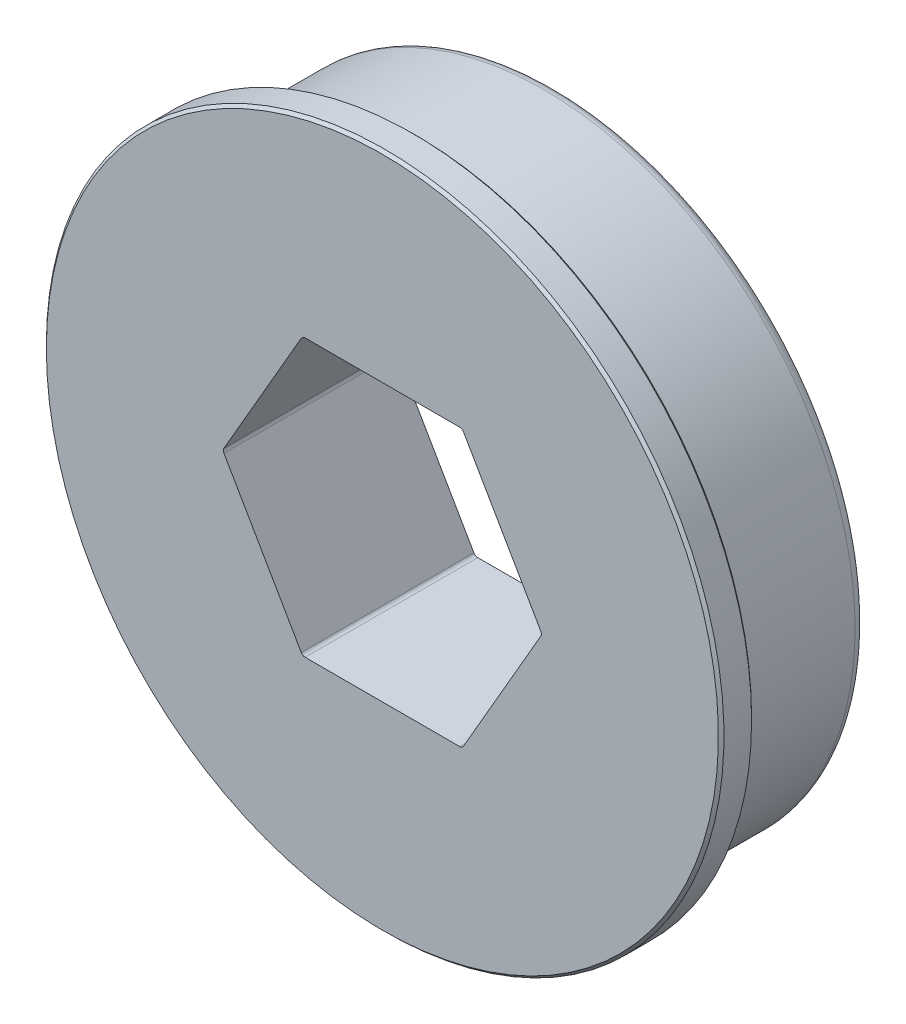
ISO-10303-21;
HEADER;
FILE_DESCRIPTION(('STEP AP214'),'2;1');
FILE_NAME('part.step','',(''),(''),'','','');
FILE_SCHEMA(('AUTOMOTIVE_DESIGN { 1 0 10303 214 1 1 1 1 }'));
ENDSEC;
DATA;
#1=APPLICATION_CONTEXT('core data for automotive mechanical design processes');
#2=APPLICATION_PROTOCOL_DEFINITION('international standard','automotive_design',2000,#1);
#3=PRODUCT_CONTEXT('',#1,'mechanical');
#4=PRODUCT('Part','Part','',(#3));
#5=PRODUCT_RELATED_PRODUCT_CATEGORY('part','',(#4));
#6=PRODUCT_DEFINITION_FORMATION('','',#4);
#7=PRODUCT_DEFINITION_CONTEXT('part definition',#1,'design');
#8=PRODUCT_DEFINITION('design','',#6,#7);
#9=PRODUCT_DEFINITION_SHAPE('','',#8);
#10=(LENGTH_UNIT() NAMED_UNIT(*) SI_UNIT(.MILLI.,.METRE.));
#11=(NAMED_UNIT(*) PLANE_ANGLE_UNIT() SI_UNIT($,.RADIAN.));
#12=(NAMED_UNIT(*) SI_UNIT($,.STERADIAN.) SOLID_ANGLE_UNIT());
#13=UNCERTAINTY_MEASURE_WITH_UNIT(LENGTH_MEASURE(1.E-05),#10,'distance_accuracy_value','');
#14=(GEOMETRIC_REPRESENTATION_CONTEXT(3) GLOBAL_UNCERTAINTY_ASSIGNED_CONTEXT((#13)) GLOBAL_UNIT_ASSIGNED_CONTEXT((#10,
#11,#12)) REPRESENTATION_CONTEXT('',''));
#15=CARTESIAN_POINT('',(0.,0.,0.));
#16=DIRECTION('',(0.,0.,1.));
#17=DIRECTION('',(1.,0.,0.));
#18=AXIS2_PLACEMENT_3D('',#15,#16,#17);
#19=CARTESIAN_POINT('',(0.,0.,7.92734));
#20=DIRECTION('',(0.,0.,-1.));
#21=DIRECTION('',(-1.,0.,0.));
#22=AXIS2_PLACEMENT_3D('',#19,#20,#21);
#23=CYLINDRICAL_SURFACE('',#22,13.97);
#24=CARTESIAN_POINT('',(0.,0.,6.40333999999999));
#25=DIRECTION('',(0.,0.,-1.));
#26=DIRECTION('',(-1.,0.,0.));
#27=AXIS2_PLACEMENT_3D('',#24,#25,#26);
#28=CIRCLE('',#27,13.97);
#29=CARTESIAN_POINT('',(-13.97,0.,6.40333999999999));
#30=VERTEX_POINT('',#29);
#31=EDGE_CURVE('E310',#30,#30,#28,.F.);
#32=ORIENTED_EDGE('',*,*,#31,.F.);
#33=EDGE_LOOP('',(#32));
#34=FACE_BOUND('',#33,.T.);
#35=CARTESIAN_POINT('',(0.,0.,5.89534));
#36=DIRECTION('',(0.,0.,-1.));
#37=DIRECTION('',(-1.,0.,0.));
#38=AXIS2_PLACEMENT_3D('',#35,#36,#37);
#39=CIRCLE('',#38,13.97);
#40=CARTESIAN_POINT('',(-13.97,0.,5.89534));
#41=VERTEX_POINT('',#40);
#42=EDGE_CURVE('E314',#41,#41,#39,.T.);
#43=ORIENTED_EDGE('',*,*,#42,.F.);
#44=EDGE_LOOP('',(#43));
#45=FACE_BOUND('',#44,.T.);
#46=ADVANCED_FACE('F16',(#34,#45),#23,.T.);
#47=CARTESIAN_POINT('',(14.2875,0.,5.89534));
#48=DIRECTION('',(0.,0.,1.));
#49=DIRECTION('',(1.,0.,0.));
#50=AXIS2_PLACEMENT_3D('',#47,#48,#49);
#51=PLANE('',#50);
#52=CARTESIAN_POINT('',(0.,0.,5.89534));
#53=DIRECTION('',(0.,0.,-1.));
#54=DIRECTION('',(-1.,0.,0.));
#55=AXIS2_PLACEMENT_3D('',#52,#53,#54);
#56=CIRCLE('',#55,14.2875);
#57=CARTESIAN_POINT('',(-14.2875,0.,5.89534));
#58=VERTEX_POINT('',#57);
#59=EDGE_CURVE('E306',#58,#58,#56,.T.);
#60=ORIENTED_EDGE('',*,*,#59,.F.);
#61=EDGE_LOOP('',(#60));
#62=FACE_BOUND('',#61,.T.);
#63=ORIENTED_EDGE('',*,*,#42,.T.);
#64=EDGE_LOOP('',(#63));
#65=FACE_BOUND('',#64,.T.);
#66=ADVANCED_FACE('F551',(#62,#65),#51,.T.);
#67=CARTESIAN_POINT('',(13.97,0.,6.40334));
#68=DIRECTION('',(0.,0.,-1.));
#69=DIRECTION('',(-1.,0.,0.));
#70=AXIS2_PLACEMENT_3D('',#67,#68,#69);
#71=PLANE('',#70);
#72=ORIENTED_EDGE('',*,*,#31,.T.);
#73=EDGE_LOOP('',(#72));
#74=FACE_BOUND('',#73,.T.);
#75=CARTESIAN_POINT('',(0.,0.,6.40334));
#76=DIRECTION('',(0.,0.,1.));
#77=DIRECTION('',(1.,0.,0.));
#78=AXIS2_PLACEMENT_3D('',#75,#76,#77);
#79=CIRCLE('',#78,15.4305);
#80=CARTESIAN_POINT('',(15.4305,0.,6.40334));
#81=VERTEX_POINT('',#80);
#82=EDGE_CURVE('E265',#81,#81,#79,.T.);
#83=ORIENTED_EDGE('',*,*,#82,.F.);
#84=EDGE_LOOP('',(#83));
#85=FACE_BOUND('',#84,.T.);
#86=ADVANCED_FACE('F543',(#74,#85),#71,.T.);
#87=CARTESIAN_POINT('',(0.,0.,7.92734));
#88=DIRECTION('',(0.,0.,-1.));
#89=DIRECTION('',(-1.,0.,0.));
#90=AXIS2_PLACEMENT_3D('',#87,#88,#89);
#91=CYLINDRICAL_SURFACE('',#90,14.2875);
#92=ORIENTED_EDGE('',*,*,#59,.T.);
#93=EDGE_LOOP('',(#92));
#94=FACE_BOUND('',#93,.T.);
#95=CARTESIAN_POINT('',(0.,0.,0.508));
#96=DIRECTION('',(0.,0.,-1.));
#97=DIRECTION('',(-1.,0.,0.));
#98=AXIS2_PLACEMENT_3D('',#95,#96,#97);
#99=CIRCLE('',#98,14.2875);
#100=CARTESIAN_POINT('',(-14.2875,0.,0.508));
#101=VERTEX_POINT('',#100);
#102=EDGE_CURVE('E261',#101,#101,#99,.T.);
#103=ORIENTED_EDGE('',*,*,#102,.F.);
#104=EDGE_LOOP('',(#103));
#105=FACE_BOUND('',#104,.T.);
#106=ADVANCED_FACE('F535',(#94,#105),#91,.T.);
#107=CARTESIAN_POINT('',(0.,0.,6.53034000000001));
#108=DIRECTION('',(0.,0.,1.));
#109=DIRECTION('',(1.,0.,0.));
#110=AXIS2_PLACEMENT_3D('',#107,#108,#109);
#111=CONICAL_SURFACE('',#110,15.5575,0.785398163397465);
#112=CARTESIAN_POINT('',(0.,0.,6.53034000000001));
#113=DIRECTION('',(0.,0.,-1.));
#114=DIRECTION('',(-1.,0.,0.));
#115=AXIS2_PLACEMENT_3D('',#112,#113,#114);
#116=CIRCLE('',#115,15.5575);
#117=CARTESIAN_POINT('',(-15.5575,0.,6.53034000000001));
#118=VERTEX_POINT('',#117);
#119=EDGE_CURVE('E100',#118,#118,#116,.F.);
#120=ORIENTED_EDGE('',*,*,#119,.F.);
#121=EDGE_LOOP('',(#120));
#122=FACE_BOUND('',#121,.T.);
#123=ORIENTED_EDGE('',*,*,#82,.T.);
#124=EDGE_LOOP('',(#123));
#125=FACE_BOUND('',#124,.T.);
#126=ADVANCED_FACE('F245',(#122,#125),#111,.T.);
#127=CARTESIAN_POINT('',(0.,0.,0.508));
#128=DIRECTION('',(0.,0.,-1.));
#129=DIRECTION('',(-1.,0.,0.));
#130=AXIS2_PLACEMENT_3D('',#127,#128,#129);
#131=TOROIDAL_SURFACE('',#130,13.7795,0.508);
#132=ORIENTED_EDGE('',*,*,#102,.T.);
#133=EDGE_LOOP('',(#132));
#134=FACE_BOUND('',#133,.T.);
#135=CARTESIAN_POINT('',(0.,0.,0.));
#136=DIRECTION('',(0.,0.,1.));
#137=DIRECTION('',(-1.,0.,0.));
#138=AXIS2_PLACEMENT_3D('',#135,#136,#137);
#139=CIRCLE('',#138,13.7795);
#140=CARTESIAN_POINT('',(13.7795,0.,0.));
#141=VERTEX_POINT('',#140);
#142=CARTESIAN_POINT('',(-13.7795,0.,0.));
#143=VERTEX_POINT('',#142);
#144=EDGE_CURVE('E293',#141,#143,#139,.F.);
#145=ORIENTED_EDGE('',*,*,#144,.F.);
#146=CARTESIAN_POINT('',(0.,0.,0.));
#147=DIRECTION('',(0.,0.,1.));
#148=DIRECTION('',(1.,0.,0.));
#149=AXIS2_PLACEMENT_3D('',#146,#147,#148);
#150=CIRCLE('',#149,13.7795);
#151=EDGE_CURVE('E187',#143,#141,#150,.F.);
#152=ORIENTED_EDGE('',*,*,#151,.F.);
#153=EDGE_LOOP('',(#145,#152));
#154=FACE_BOUND('',#153,.T.);
#155=ADVANCED_FACE('F239',(#134,#154),#131,.T.);
#156=CARTESIAN_POINT('',(0.,0.,7.92734));
#157=DIRECTION('',(0.,0.,-1.));
#158=DIRECTION('',(-1.,0.,0.));
#159=AXIS2_PLACEMENT_3D('',#156,#157,#158);
#160=CYLINDRICAL_SURFACE('',#159,15.5575);
#161=ORIENTED_EDGE('',*,*,#119,.T.);
#162=EDGE_LOOP('',(#161));
#163=FACE_BOUND('',#162,.T.);
#164=CARTESIAN_POINT('',(0.,0.,7.80034));
#165=DIRECTION('',(0.,0.,-1.));
#166=DIRECTION('',(-1.,0.,0.));
#167=AXIS2_PLACEMENT_3D('',#164,#165,#166);
#168=CIRCLE('',#167,15.5575);
#169=CARTESIAN_POINT('',(-15.5575,0.,7.80034));
#170=VERTEX_POINT('',#169);
#171=EDGE_CURVE('E177',#170,#170,#168,.F.);
#172=ORIENTED_EDGE('',*,*,#171,.F.);
#173=EDGE_LOOP('',(#172));
#174=FACE_BOUND('',#173,.T.);
#175=ADVANCED_FACE('F244',(#163,#174),#160,.T.);
#176=CARTESIAN_POINT('',(-7.09771326930958,0.,7.92734));
#177=DIRECTION('',(0.,0.,1.));
#178=DIRECTION('',(1.,0.,0.));
#179=AXIS2_PLACEMENT_3D('',#176,#177,#178);
#180=CYLINDRICAL_SURFACE('',#179,0.2032);
#181=DIRECTION('',(0.,0.,1.));
#182=VECTOR('',#181,1.);
#183=CARTESIAN_POINT('',(-7.27368963135858,-0.101600000000005,7.92734));
#184=LINE('',#183,#182);
#185=CARTESIAN_POINT('',(-7.27368963135857,-0.101600000000006,7.92734));
#186=VERTEX_POINT('',#185);
#187=CARTESIAN_POINT('',(-7.27368963135857,-0.101600000000005,0.));
#188=VERTEX_POINT('',#187);
#189=EDGE_CURVE('E174',#186,#188,#184,.F.);
#190=ORIENTED_EDGE('',*,*,#189,.T.);
#191=CARTESIAN_POINT('',(-7.09771326930958,0.,0.));
#192=DIRECTION('',(0.,0.,1.));
#193=DIRECTION('',(1.,0.,0.));
#194=AXIS2_PLACEMENT_3D('',#191,#192,#193);
#195=CIRCLE('',#194,0.2032);
#196=CARTESIAN_POINT('',(-7.27368963135857,0.101599999999994,0.));
#197=VERTEX_POINT('',#196);
#198=EDGE_CURVE('E108',#197,#188,#195,.T.);
#199=ORIENTED_EDGE('',*,*,#198,.F.);
#200=DIRECTION('',(0.,0.,1.));
#201=VECTOR('',#200,1.);
#202=CARTESIAN_POINT('',(-7.27368963135857,0.101599999999993,7.92734));
#203=LINE('',#202,#201);
#204=CARTESIAN_POINT('',(-7.27368963135857,0.101599999999994,7.92734));
#205=VERTEX_POINT('',#204);
#206=EDGE_CURVE('E104',#197,#205,#203,.T.);
#207=ORIENTED_EDGE('',*,*,#206,.T.);
#208=CARTESIAN_POINT('',(-7.09771326930958,0.,7.92734));
#209=DIRECTION('',(0.,0.,1.));
#210=DIRECTION('',(1.,0.,0.));
#211=AXIS2_PLACEMENT_3D('',#208,#209,#210);
#212=CIRCLE('',#211,0.2032);
#213=EDGE_CURVE('E86',#186,#205,#212,.F.);
#214=ORIENTED_EDGE('',*,*,#213,.F.);
#215=EDGE_LOOP('',(#190,#199,#207,#214));
#216=FACE_BOUND('',#215,.T.);
#217=ADVANCED_FACE('F105',(#216),#180,.F.);
#218=CARTESIAN_POINT('',(-3.54885663465479,6.14679999999999,7.92734));
#219=DIRECTION('',(0.,0.,1.));
#220=DIRECTION('',(1.,0.,0.));
#221=AXIS2_PLACEMENT_3D('',#218,#219,#220);
#222=CYLINDRICAL_SURFACE('',#221,0.2032);
#223=DIRECTION('',(0.,0.,1.));
#224=VECTOR('',#223,1.);
#225=CARTESIAN_POINT('',(-3.72483299670379,6.24839999999999,7.92734));
#226=LINE('',#225,#224);
#227=CARTESIAN_POINT('',(-3.72483299670379,6.24839999999999,7.92734));
#228=VERTEX_POINT('',#227);
#229=CARTESIAN_POINT('',(-3.72483299670378,6.24839999999999,0.));
#230=VERTEX_POINT('',#229);
#231=EDGE_CURVE('E119',#228,#230,#226,.F.);
#232=ORIENTED_EDGE('',*,*,#231,.T.);
#233=CARTESIAN_POINT('',(-3.54885663465479,6.14679999999999,0.));
#234=DIRECTION('',(0.,0.,1.));
#235=DIRECTION('',(1.,0.,0.));
#236=AXIS2_PLACEMENT_3D('',#233,#234,#235);
#237=CIRCLE('',#236,0.2032);
#238=CARTESIAN_POINT('',(-3.54885663465479,6.34999999999999,0.));
#239=VERTEX_POINT('',#238);
#240=EDGE_CURVE('E275',#239,#230,#237,.T.);
#241=ORIENTED_EDGE('',*,*,#240,.F.);
#242=DIRECTION('',(0.,0.,1.));
#243=VECTOR('',#242,1.);
#244=CARTESIAN_POINT('',(-3.54885663465479,6.34999999999999,7.92734));
#245=LINE('',#244,#243);
#246=CARTESIAN_POINT('',(-3.54885663465479,6.34999999999999,7.92734));
#247=VERTEX_POINT('',#246);
#248=EDGE_CURVE('E113',#239,#247,#245,.T.);
#249=ORIENTED_EDGE('',*,*,#248,.T.);
#250=CARTESIAN_POINT('',(-3.54885663465479,6.14679999999999,7.92734));
#251=DIRECTION('',(0.,0.,1.));
#252=DIRECTION('',(1.,0.,0.));
#253=AXIS2_PLACEMENT_3D('',#250,#251,#252);
#254=CIRCLE('',#253,0.2032);
#255=EDGE_CURVE('E99',#228,#247,#254,.F.);
#256=ORIENTED_EDGE('',*,*,#255,.F.);
#257=EDGE_LOOP('',(#232,#241,#249,#256));
#258=FACE_BOUND('',#257,.T.);
#259=ADVANCED_FACE('F500',(#258),#222,.F.);
#260=CARTESIAN_POINT('',(3.5488566346548,6.1468,7.92734));
#261=DIRECTION('',(0.,0.,1.));
#262=DIRECTION('',(1.,0.,0.));
#263=AXIS2_PLACEMENT_3D('',#260,#261,#262);
#264=CYLINDRICAL_SURFACE('',#263,0.2032);
#265=DIRECTION('',(0.,0.,1.));
#266=VECTOR('',#265,1.);
#267=CARTESIAN_POINT('',(3.5488566346548,6.35,7.92734));
#268=LINE('',#267,#266);
#269=CARTESIAN_POINT('',(3.5488566346548,6.34999999999999,7.92734));
#270=VERTEX_POINT('',#269);
#271=CARTESIAN_POINT('',(3.5488566346548,6.35,0.));
#272=VERTEX_POINT('',#271);
#273=EDGE_CURVE('E164',#270,#272,#268,.F.);
#274=ORIENTED_EDGE('',*,*,#273,.T.);
#275=CARTESIAN_POINT('',(3.5488566346548,6.1468,0.));
#276=DIRECTION('',(0.,0.,1.));
#277=DIRECTION('',(1.,0.,0.));
#278=AXIS2_PLACEMENT_3D('',#275,#276,#277);
#279=CIRCLE('',#278,0.2032);
#280=CARTESIAN_POINT('',(3.7248329967038,6.2484,0.));
#281=VERTEX_POINT('',#280);
#282=EDGE_CURVE('E279',#281,#272,#279,.T.);
#283=ORIENTED_EDGE('',*,*,#282,.F.);
#284=DIRECTION('',(0.,0.,1.));
#285=VECTOR('',#284,1.);
#286=CARTESIAN_POINT('',(3.72483299670379,6.2484,7.92734));
#287=LINE('',#286,#285);
#288=CARTESIAN_POINT('',(3.72483299670379,6.2484,7.92734));
#289=VERTEX_POINT('',#288);
#290=EDGE_CURVE('E151',#281,#289,#287,.T.);
#291=ORIENTED_EDGE('',*,*,#290,.T.);
#292=CARTESIAN_POINT('',(3.5488566346548,6.1468,7.92734));
#293=DIRECTION('',(0.,0.,1.));
#294=DIRECTION('',(1.,0.,0.));
#295=AXIS2_PLACEMENT_3D('',#292,#293,#294);
#296=CIRCLE('',#295,0.2032);
#297=EDGE_CURVE('E299',#270,#289,#296,.F.);
#298=ORIENTED_EDGE('',*,*,#297,.F.);
#299=EDGE_LOOP('',(#274,#283,#291,#298));
#300=FACE_BOUND('',#299,.T.);
#301=ADVANCED_FACE('F493',(#300),#264,.F.);
#302=CARTESIAN_POINT('',(7.09771326930959,0.,7.92734));
#303=DIRECTION('',(0.,0.,1.));
#304=DIRECTION('',(1.,0.,0.));
#305=AXIS2_PLACEMENT_3D('',#302,#303,#304);
#306=CYLINDRICAL_SURFACE('',#305,0.2032);
#307=CARTESIAN_POINT('',(7.09771326930959,0.,0.));
#308=DIRECTION('',(0.,0.,1.));
#309=DIRECTION('',(1.,0.,0.));
#310=AXIS2_PLACEMENT_3D('',#307,#308,#309);
#311=CIRCLE('',#310,0.2032);
#312=CARTESIAN_POINT('',(7.27368963135859,-0.101600000000005,0.));
#313=VERTEX_POINT('',#312);
#314=CARTESIAN_POINT('',(7.27368963135859,0.101599999999995,0.));
#315=VERTEX_POINT('',#314);
#316=EDGE_CURVE('E283',#313,#315,#311,.T.);
#317=ORIENTED_EDGE('',*,*,#316,.F.);
#318=DIRECTION('',(0.,0.,1.));
#319=VECTOR('',#318,1.);
#320=CARTESIAN_POINT('',(7.27368963135859,-0.101600000000005,7.92734));
#321=LINE('',#320,#319);
#322=CARTESIAN_POINT('',(7.27368963135859,-0.101600000000005,7.92734));
#323=VERTEX_POINT('',#322);
#324=EDGE_CURVE('E142',#313,#323,#321,.T.);
#325=ORIENTED_EDGE('',*,*,#324,.T.);
#326=CARTESIAN_POINT('',(7.09771326930959,0.,7.92734));
#327=DIRECTION('',(0.,0.,1.));
#328=DIRECTION('',(1.,0.,0.));
#329=AXIS2_PLACEMENT_3D('',#326,#327,#328);
#330=CIRCLE('',#329,0.2032);
#331=CARTESIAN_POINT('',(7.27368963135859,0.101599999999995,7.92734));
#332=VERTEX_POINT('',#331);
#333=EDGE_CURVE('E296',#332,#323,#330,.F.);
#334=ORIENTED_EDGE('',*,*,#333,.F.);
#335=DIRECTION('',(0.,0.,1.));
#336=VECTOR('',#335,1.);
#337=CARTESIAN_POINT('',(7.27368963135859,0.101599999999995,7.92734));
#338=LINE('',#337,#336);
#339=EDGE_CURVE('E156',#332,#315,#338,.F.);
#340=ORIENTED_EDGE('',*,*,#339,.T.);
#341=EDGE_LOOP('',(#317,#325,#334,#340));
#342=FACE_BOUND('',#341,.T.);
#343=ADVANCED_FACE('F339',(#342),#306,.F.);
#344=CARTESIAN_POINT('',(-3.54885663465478,-6.14680000000001,7.92734));
#345=DIRECTION('',(0.,0.,1.));
#346=DIRECTION('',(1.,0.,0.));
#347=AXIS2_PLACEMENT_3D('',#344,#345,#346);
#348=CYLINDRICAL_SURFACE('',#347,0.2032);
#349=DIRECTION('',(0.,0.,-1.));
#350=VECTOR('',#349,1.);
#351=CARTESIAN_POINT('',(-3.54885663465478,-6.35000000000001,7.92734));
#352=LINE('',#351,#350);
#353=CARTESIAN_POINT('',(-3.54885663465478,-6.35000000000001,7.92734));
#354=VERTEX_POINT('',#353);
#355=CARTESIAN_POINT('',(-3.54885663465478,-6.35000000000001,0.));
#356=VERTEX_POINT('',#355);
#357=EDGE_CURVE('E139',#354,#356,#352,.T.);
#358=ORIENTED_EDGE('',*,*,#357,.T.);
#359=CARTESIAN_POINT('',(-3.54885663465478,-6.14680000000001,0.));
#360=DIRECTION('',(0.,0.,1.));
#361=DIRECTION('',(1.,0.,0.));
#362=AXIS2_PLACEMENT_3D('',#359,#360,#361);
#363=CIRCLE('',#362,0.2032);
#364=CARTESIAN_POINT('',(-3.72483299670378,-6.24840000000001,0.));
#365=VERTEX_POINT('',#364);
#366=EDGE_CURVE('E287',#365,#356,#363,.T.);
#367=ORIENTED_EDGE('',*,*,#366,.F.);
#368=DIRECTION('',(0.,0.,1.));
#369=VECTOR('',#368,1.);
#370=CARTESIAN_POINT('',(-3.72483299670378,-6.24840000000001,7.92734));
#371=LINE('',#370,#369);
#372=CARTESIAN_POINT('',(-3.72483299670378,-6.24840000000001,7.92734));
#373=VERTEX_POINT('',#372);
#374=EDGE_CURVE('E170',#365,#373,#371,.T.);
#375=ORIENTED_EDGE('',*,*,#374,.T.);
#376=CARTESIAN_POINT('',(-3.54885663465478,-6.14680000000001,7.92734));
#377=DIRECTION('',(0.,0.,1.));
#378=DIRECTION('',(1.,0.,0.));
#379=AXIS2_PLACEMENT_3D('',#376,#377,#378);
#380=CIRCLE('',#379,0.2032);
#381=EDGE_CURVE('E41',#354,#373,#380,.F.);
#382=ORIENTED_EDGE('',*,*,#381,.F.);
#383=EDGE_LOOP('',(#358,#367,#375,#382));
#384=FACE_BOUND('',#383,.T.);
#385=ADVANCED_FACE('F204',(#384),#348,.F.);
#386=CARTESIAN_POINT('',(0.,0.,0.));
#387=DIRECTION('',(0.,0.,-1.));
#388=DIRECTION('',(-1.,0.,0.));
#389=AXIS2_PLACEMENT_3D('',#386,#387,#388);
#390=PLANE('',#389);
#391=DIRECTION('',(-1.,0.,0.));
#392=VECTOR('',#391,1.);
#393=CARTESIAN_POINT('',(-3.66617420935412,6.34999999999999,0.));
#394=LINE('',#393,#392);
#395=EDGE_CURVE('E160',#272,#239,#394,.T.);
#396=ORIENTED_EDGE('',*,*,#395,.T.);
#397=ORIENTED_EDGE('',*,*,#240,.T.);
#398=DIRECTION('',(-0.5,-0.866025403784439,0.));
#399=VECTOR('',#398,1.);
#400=CARTESIAN_POINT('',(-7.33234841870824,0.,0.));
#401=LINE('',#400,#399);
#402=EDGE_CURVE('E114',#230,#197,#401,.T.);
#403=ORIENTED_EDGE('',*,*,#402,.T.);
#404=ORIENTED_EDGE('',*,*,#198,.T.);
#405=DIRECTION('',(0.5,-0.866025403784439,0.));
#406=VECTOR('',#405,1.);
#407=CARTESIAN_POINT('',(-3.66617420935411,-6.35000000000001,0.));
#408=LINE('',#407,#406);
#409=EDGE_CURVE('E173',#188,#365,#408,.T.);
#410=ORIENTED_EDGE('',*,*,#409,.T.);
#411=ORIENTED_EDGE('',*,*,#366,.T.);
#412=DIRECTION('',(1.,0.,0.));
#413=VECTOR('',#412,1.);
#414=CARTESIAN_POINT('',(3.66617420935413,-6.35000000000001,0.));
#415=LINE('',#414,#413);
#416=CARTESIAN_POINT('',(3.5488566346548,-6.35000000000001,0.));
#417=VERTEX_POINT('',#416);
#418=EDGE_CURVE('E138',#356,#417,#415,.T.);
#419=ORIENTED_EDGE('',*,*,#418,.T.);
#420=CARTESIAN_POINT('',(3.5488566346548,-6.14680000000001,0.));
#421=DIRECTION('',(0.,0.,1.));
#422=DIRECTION('',(1.,0.,0.));
#423=AXIS2_PLACEMENT_3D('',#420,#421,#422);
#424=CIRCLE('',#423,0.2032);
#425=CARTESIAN_POINT('',(3.7248329967038,-6.24840000000001,0.));
#426=VERTEX_POINT('',#425);
#427=EDGE_CURVE('E271',#417,#426,#424,.T.);
#428=ORIENTED_EDGE('',*,*,#427,.T.);
#429=DIRECTION('',(0.5,0.866025403784439,0.));
#430=VECTOR('',#429,1.);
#431=CARTESIAN_POINT('',(7.33234841870825,0.,0.));
#432=LINE('',#431,#430);
#433=EDGE_CURVE('E146',#426,#313,#432,.T.);
#434=ORIENTED_EDGE('',*,*,#433,.T.);
#435=ORIENTED_EDGE('',*,*,#316,.T.);
#436=DIRECTION('',(-0.5,0.866025403784439,0.));
#437=VECTOR('',#436,1.);
#438=CARTESIAN_POINT('',(3.66617420935413,6.35,0.));
#439=LINE('',#438,#437);
#440=EDGE_CURVE('E155',#315,#281,#439,.T.);
#441=ORIENTED_EDGE('',*,*,#440,.T.);
#442=ORIENTED_EDGE('',*,*,#282,.T.);
#443=EDGE_LOOP('',(#396,#397,#403,#404,#410,#411,#419,#428,#434,#435,#441,#442));
#444=FACE_BOUND('',#443,.T.);
#445=ORIENTED_EDGE('',*,*,#151,.T.);
#446=ORIENTED_EDGE('',*,*,#144,.T.);
#447=EDGE_LOOP('',(#445,#446));
#448=FACE_BOUND('',#447,.T.);
#449=ADVANCED_FACE('F193',(#444,#448),#390,.T.);
#450=CARTESIAN_POINT('',(3.5488566346548,-6.14680000000001,7.92734));
#451=DIRECTION('',(0.,0.,1.));
#452=DIRECTION('',(1.,0.,0.));
#453=AXIS2_PLACEMENT_3D('',#450,#451,#452);
#454=CYLINDRICAL_SURFACE('',#453,0.2032);
#455=DIRECTION('',(0.,0.,1.));
#456=VECTOR('',#455,1.);
#457=CARTESIAN_POINT('',(3.7248329967038,-6.2484,7.92734));
#458=LINE('',#457,#456);
#459=CARTESIAN_POINT('',(3.7248329967038,-6.2484,7.92734));
#460=VERTEX_POINT('',#459);
#461=EDGE_CURVE('E147',#460,#426,#458,.F.);
#462=ORIENTED_EDGE('',*,*,#461,.T.);
#463=ORIENTED_EDGE('',*,*,#427,.F.);
#464=DIRECTION('',(0.,0.,-1.));
#465=VECTOR('',#464,1.);
#466=CARTESIAN_POINT('',(3.5488566346548,-6.35000000000001,7.92734));
#467=LINE('',#466,#465);
#468=CARTESIAN_POINT('',(3.5488566346548,-6.35000000000001,7.92734));
#469=VERTEX_POINT('',#468);
#470=EDGE_CURVE('E134',#417,#469,#467,.F.);
#471=ORIENTED_EDGE('',*,*,#470,.T.);
#472=CARTESIAN_POINT('',(3.5488566346548,-6.14680000000001,7.92734));
#473=DIRECTION('',(0.,0.,1.));
#474=DIRECTION('',(1.,0.,0.));
#475=AXIS2_PLACEMENT_3D('',#472,#473,#474);
#476=CIRCLE('',#475,0.2032);
#477=EDGE_CURVE('E234',#460,#469,#476,.F.);
#478=ORIENTED_EDGE('',*,*,#477,.F.);
#479=EDGE_LOOP('',(#462,#463,#471,#478));
#480=FACE_BOUND('',#479,.T.);
#481=ADVANCED_FACE('F203',(#480),#454,.F.);
#482=CARTESIAN_POINT('',(0.,0.,7.80034));
#483=DIRECTION('',(0.,0.,-1.));
#484=DIRECTION('',(-1.,0.,0.));
#485=AXIS2_PLACEMENT_3D('',#482,#483,#484);
#486=CONICAL_SURFACE('',#485,15.5575,0.785398163397442);
#487=ORIENTED_EDGE('',*,*,#171,.T.);
#488=EDGE_LOOP('',(#487));
#489=FACE_BOUND('',#488,.T.);
#490=CARTESIAN_POINT('',(0.,0.,7.92734));
#491=DIRECTION('',(0.,0.,-1.));
#492=DIRECTION('',(-1.,0.,0.));
#493=AXIS2_PLACEMENT_3D('',#490,#491,#492);
#494=CIRCLE('',#493,15.4305);
#495=CARTESIAN_POINT('',(-15.4305,0.,7.92734));
#496=VERTEX_POINT('',#495);
#497=EDGE_CURVE('E130',#496,#496,#494,.F.);
#498=ORIENTED_EDGE('',*,*,#497,.F.);
#499=EDGE_LOOP('',(#498));
#500=FACE_BOUND('',#499,.T.);
#501=ADVANCED_FACE('F395',(#489,#500),#486,.T.);
#502=CARTESIAN_POINT('',(-3.66617420935411,-6.35000000000001,7.92734));
#503=DIRECTION('',(-0.866025403784439,-0.5,0.));
#504=DIRECTION('',(0.5,-0.866025403784439,0.));
#505=AXIS2_PLACEMENT_3D('',#502,#503,#504);
#506=PLANE('',#505);
#507=ORIENTED_EDGE('',*,*,#374,.F.);
#508=ORIENTED_EDGE('',*,*,#409,.F.);
#509=ORIENTED_EDGE('',*,*,#189,.F.);
#510=DIRECTION('',(-0.5,0.866025403784438,0.));
#511=VECTOR('',#510,1.);
#512=CARTESIAN_POINT('',(-3.72483299670378,-6.24840000000001,7.92734));
#513=LINE('',#512,#511);
#514=EDGE_CURVE('E97',#373,#186,#513,.T.);
#515=ORIENTED_EDGE('',*,*,#514,.F.);
#516=EDGE_LOOP('',(#507,#508,#509,#515));
#517=FACE_BOUND('',#516,.T.);
#518=ADVANCED_FACE('F388',(#517),#506,.F.);
#519=CARTESIAN_POINT('',(-7.33234841870824,0.,7.92734));
#520=DIRECTION('',(-0.866025403784439,0.5,0.));
#521=DIRECTION('',(-0.5,-0.866025403784439,0.));
#522=AXIS2_PLACEMENT_3D('',#519,#520,#521);
#523=PLANE('',#522);
#524=ORIENTED_EDGE('',*,*,#206,.F.);
#525=ORIENTED_EDGE('',*,*,#402,.F.);
#526=ORIENTED_EDGE('',*,*,#231,.F.);
#527=DIRECTION('',(0.5,0.866025403784439,0.));
#528=VECTOR('',#527,1.);
#529=CARTESIAN_POINT('',(-7.27368963135857,0.101599999999993,7.92734));
#530=LINE('',#529,#528);
#531=EDGE_CURVE('E95',#205,#228,#530,.T.);
#532=ORIENTED_EDGE('',*,*,#531,.F.);
#533=EDGE_LOOP('',(#524,#525,#526,#532));
#534=FACE_BOUND('',#533,.T.);
#535=ADVANCED_FACE('F117',(#534),#523,.F.);
#536=CARTESIAN_POINT('',(-3.66617420935412,6.34999999999999,7.92734));
#537=DIRECTION('',(0.,1.,0.));
#538=DIRECTION('',(-1.,0.,0.));
#539=AXIS2_PLACEMENT_3D('',#536,#537,#538);
#540=PLANE('',#539);
#541=ORIENTED_EDGE('',*,*,#273,.F.);
#542=DIRECTION('',(1.,0.,0.));
#543=VECTOR('',#542,1.);
#544=CARTESIAN_POINT('',(15.5575,6.34999999999999,7.92734));
#545=LINE('',#544,#543);
#546=EDGE_CURVE('E121',#247,#270,#545,.T.);
#547=ORIENTED_EDGE('',*,*,#546,.F.);
#548=ORIENTED_EDGE('',*,*,#248,.F.);
#549=ORIENTED_EDGE('',*,*,#395,.F.);
#550=EDGE_LOOP('',(#541,#547,#548,#549));
#551=FACE_BOUND('',#550,.T.);
#552=ADVANCED_FACE('F412',(#551),#540,.F.);
#553=CARTESIAN_POINT('',(3.66617420935413,6.35,7.92734));
#554=DIRECTION('',(0.866025403784439,0.5,0.));
#555=DIRECTION('',(-0.5,0.866025403784439,0.));
#556=AXIS2_PLACEMENT_3D('',#553,#554,#555);
#557=PLANE('',#556);
#558=ORIENTED_EDGE('',*,*,#290,.F.);
#559=ORIENTED_EDGE('',*,*,#440,.F.);
#560=ORIENTED_EDGE('',*,*,#339,.F.);
#561=DIRECTION('',(0.5,-0.866025403784438,0.));
#562=VECTOR('',#561,1.);
#563=CARTESIAN_POINT('',(3.72483299670379,6.2484,7.92734));
#564=LINE('',#563,#562);
#565=EDGE_CURVE('E127',#289,#332,#564,.T.);
#566=ORIENTED_EDGE('',*,*,#565,.F.);
#567=EDGE_LOOP('',(#558,#559,#560,#566));
#568=FACE_BOUND('',#567,.T.);
#569=ADVANCED_FACE('F333',(#568),#557,.F.);
#570=CARTESIAN_POINT('',(7.33234841870825,0.,7.92734));
#571=DIRECTION('',(0.866025403784439,-0.5,0.));
#572=DIRECTION('',(0.5,0.866025403784439,0.));
#573=AXIS2_PLACEMENT_3D('',#570,#571,#572);
#574=PLANE('',#573);
#575=ORIENTED_EDGE('',*,*,#324,.F.);
#576=ORIENTED_EDGE('',*,*,#433,.F.);
#577=ORIENTED_EDGE('',*,*,#461,.F.);
#578=DIRECTION('',(-0.5,-0.866025403784439,0.));
#579=VECTOR('',#578,1.);
#580=CARTESIAN_POINT('',(7.27368963135859,-0.101600000000005,7.92734));
#581=LINE('',#580,#579);
#582=EDGE_CURVE('E28',#323,#460,#581,.T.);
#583=ORIENTED_EDGE('',*,*,#582,.F.);
#584=EDGE_LOOP('',(#575,#576,#577,#583));
#585=FACE_BOUND('',#584,.T.);
#586=ADVANCED_FACE('F354',(#585),#574,.F.);
#587=CARTESIAN_POINT('',(3.66617420935413,-6.35000000000001,7.92734));
#588=DIRECTION('',(0.,-1.,0.));
#589=DIRECTION('',(0.,0.,-1.));
#590=AXIS2_PLACEMENT_3D('',#587,#588,#589);
#591=PLANE('',#590);
#592=ORIENTED_EDGE('',*,*,#470,.F.);
#593=ORIENTED_EDGE('',*,*,#418,.F.);
#594=ORIENTED_EDGE('',*,*,#357,.F.);
#595=DIRECTION('',(1.,0.,0.));
#596=VECTOR('',#595,1.);
#597=CARTESIAN_POINT('',(15.5575,-6.35000000000001,7.92734));
#598=LINE('',#597,#596);
#599=EDGE_CURVE('E11',#469,#354,#598,.F.);
#600=ORIENTED_EDGE('',*,*,#599,.F.);
#601=EDGE_LOOP('',(#592,#593,#594,#600));
#602=FACE_BOUND('',#601,.T.);
#603=ADVANCED_FACE('F392',(#602),#591,.F.);
#604=CARTESIAN_POINT('',(15.5575,0.,7.92734));
#605=DIRECTION('',(0.,0.,1.));
#606=DIRECTION('',(1.,0.,0.));
#607=AXIS2_PLACEMENT_3D('',#604,#605,#606);
#608=PLANE('',#607);
#609=ORIENTED_EDGE('',*,*,#599,.T.);
#610=ORIENTED_EDGE('',*,*,#381,.T.);
#611=ORIENTED_EDGE('',*,*,#514,.T.);
#612=ORIENTED_EDGE('',*,*,#213,.T.);
#613=ORIENTED_EDGE('',*,*,#531,.T.);
#614=ORIENTED_EDGE('',*,*,#255,.T.);
#615=ORIENTED_EDGE('',*,*,#546,.T.);
#616=ORIENTED_EDGE('',*,*,#297,.T.);
#617=ORIENTED_EDGE('',*,*,#565,.T.);
#618=ORIENTED_EDGE('',*,*,#333,.T.);
#619=ORIENTED_EDGE('',*,*,#582,.T.);
#620=ORIENTED_EDGE('',*,*,#477,.T.);
#621=EDGE_LOOP('',(#609,#610,#611,#612,#613,#614,#615,#616,#617,#618,#619,#620));
#622=FACE_BOUND('',#621,.T.);
#623=ORIENTED_EDGE('',*,*,#497,.T.);
#624=EDGE_LOOP('',(#623));
#625=FACE_BOUND('',#624,.T.);
#626=ADVANCED_FACE('F92',(#622,#625),#608,.T.);
#627=CLOSED_SHELL('',(#46,#66,#86,#106,#126,#155,#175,#217,#259,#301,#343,#385,#449,#481,#501,
#518,#535,#552,#569,#586,#603,#626));
#628=MANIFOLD_SOLID_BREP('B1',#627);
#629=ADVANCED_BREP_SHAPE_REPRESENTATION('',(#18,#628),#14);
#630=SHAPE_DEFINITION_REPRESENTATION(#9,#629);
ENDSEC;
END-ISO-10303-21;
